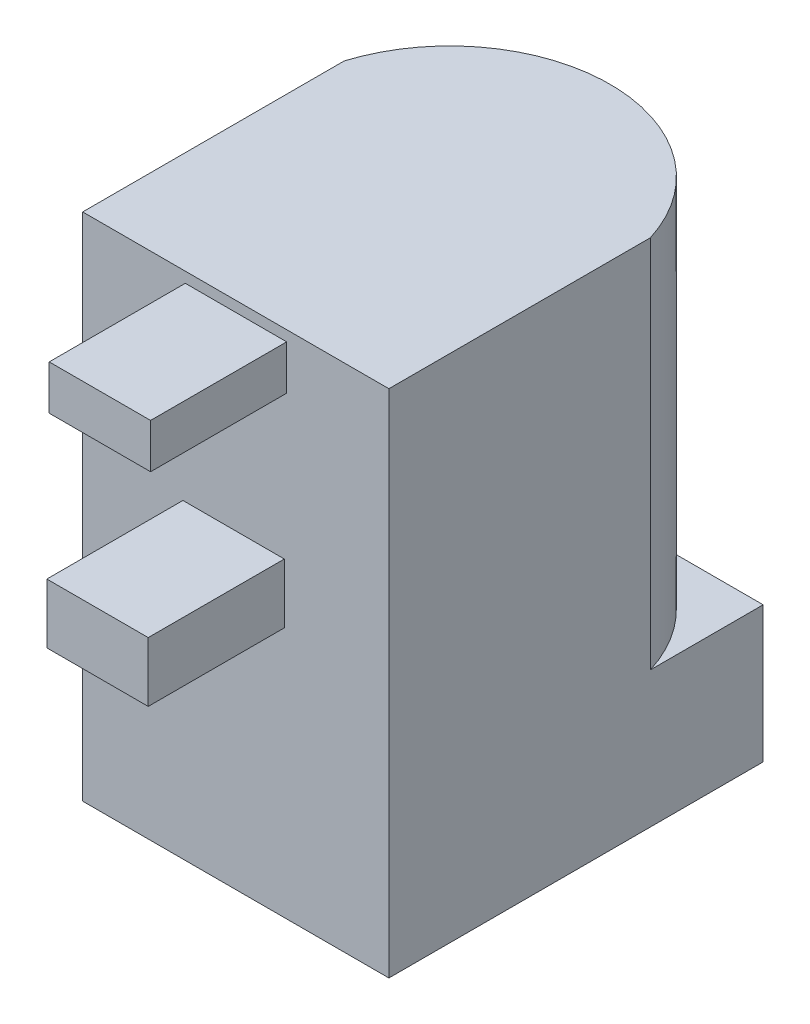
ISO-10303-21;
HEADER;
FILE_DESCRIPTION(('STEP AP214'),'2;1');
FILE_NAME('part.step','',(''),(''),'','','');
FILE_SCHEMA(('AUTOMOTIVE_DESIGN { 1 0 10303 214 1 1 1 1 }'));
ENDSEC;
DATA;
#1=APPLICATION_CONTEXT('core data for automotive mechanical design processes');
#2=APPLICATION_PROTOCOL_DEFINITION('international standard','automotive_design',2000,#1);
#3=PRODUCT_CONTEXT('',#1,'mechanical');
#4=PRODUCT('Part','Part','',(#3));
#5=PRODUCT_RELATED_PRODUCT_CATEGORY('part','',(#4));
#6=PRODUCT_DEFINITION_FORMATION('','',#4);
#7=PRODUCT_DEFINITION_CONTEXT('part definition',#1,'design');
#8=PRODUCT_DEFINITION('design','',#6,#7);
#9=PRODUCT_DEFINITION_SHAPE('','',#8);
#10=(LENGTH_UNIT() NAMED_UNIT(*) SI_UNIT(.MILLI.,.METRE.));
#11=(NAMED_UNIT(*) PLANE_ANGLE_UNIT() SI_UNIT($,.RADIAN.));
#12=(NAMED_UNIT(*) SI_UNIT($,.STERADIAN.) SOLID_ANGLE_UNIT());
#13=UNCERTAINTY_MEASURE_WITH_UNIT(LENGTH_MEASURE(1.E-05),#10,'distance_accuracy_value','');
#14=(GEOMETRIC_REPRESENTATION_CONTEXT(3) GLOBAL_UNCERTAINTY_ASSIGNED_CONTEXT((#13)) GLOBAL_UNIT_ASSIGNED_CONTEXT((#10,
#11,#12)) REPRESENTATION_CONTEXT('',''));
#15=CARTESIAN_POINT('',(0.,0.,0.));
#16=DIRECTION('',(0.,0.,1.));
#17=DIRECTION('',(1.,0.,0.));
#18=AXIS2_PLACEMENT_3D('',#15,#16,#17);
#19=CARTESIAN_POINT('',(-3.84818941504178,15.,5.33426183844011));
#20=DIRECTION('',(0.,0.,-1.));
#21=DIRECTION('',(-1.,0.,0.));
#22=AXIS2_PLACEMENT_3D('',#19,#20,#21);
#23=PLANE('',#22);
#24=DIRECTION('',(0.,-1.,0.));
#25=VECTOR('',#24,1.);
#26=CARTESIAN_POINT('',(-0.832403017018213,13.3838371317521,5.33426183844011));
#27=LINE('',#26,#25);
#28=CARTESIAN_POINT('',(-0.832403017018213,14.6905222156593,5.33426183844011));
#29=VERTEX_POINT('',#28);
#30=CARTESIAN_POINT('',(-0.832403017018213,13.3838371317521,5.33426183844011));
#31=VERTEX_POINT('',#30);
#32=EDGE_CURVE('E160',#29,#31,#27,.T.);
#33=ORIENTED_EDGE('',*,*,#32,.F.);
#34=DIRECTION('',(-1.,0.,0.));
#35=VECTOR('',#34,1.);
#36=CARTESIAN_POINT('',(-0.832403017018213,14.6905222156593,5.33426183844011));
#37=LINE('',#36,#35);
#38=CARTESIAN_POINT('',(2.14747638164835,14.6905222156593,5.33426183844011));
#39=VERTEX_POINT('',#38);
#40=EDGE_CURVE('E173',#39,#29,#37,.T.);
#41=ORIENTED_EDGE('',*,*,#40,.F.);
#42=DIRECTION('',(0.,1.,0.));
#43=VECTOR('',#42,1.);
#44=CARTESIAN_POINT('',(2.14747638164835,13.3838371317521,5.33426183844011));
#45=LINE('',#44,#43);
#46=CARTESIAN_POINT('',(2.14747638164835,13.3838371317521,5.33426183844011));
#47=VERTEX_POINT('',#46);
#48=EDGE_CURVE('E182',#47,#39,#45,.T.);
#49=ORIENTED_EDGE('',*,*,#48,.F.);
#50=DIRECTION('',(1.,0.,0.));
#51=VECTOR('',#50,1.);
#52=CARTESIAN_POINT('',(-0.832403017018213,13.3838371317521,5.33426183844011));
#53=LINE('',#52,#51);
#54=EDGE_CURVE('E163',#31,#47,#53,.T.);
#55=ORIENTED_EDGE('',*,*,#54,.F.);
#56=EDGE_LOOP('',(#33,#41,#49,#55));
#57=FACE_BOUND('',#56,.T.);
#58=DIRECTION('',(1.,0.,0.));
#59=VECTOR('',#58,1.);
#60=CARTESIAN_POINT('',(-3.84818941504178,0.,5.33426183844011));
#61=LINE('',#60,#59);
#62=CARTESIAN_POINT('',(-3.84818941504178,0.,5.33426183844011));
#63=VERTEX_POINT('',#62);
#64=CARTESIAN_POINT('',(5.15181058495822,0.,5.33426183844011));
#65=VERTEX_POINT('',#64);
#66=EDGE_CURVE('E232',#63,#65,#61,.T.);
#67=ORIENTED_EDGE('',*,*,#66,.T.);
#68=DIRECTION('',(0.,-1.,0.));
#69=VECTOR('',#68,1.);
#70=CARTESIAN_POINT('',(5.15181058495822,15.,5.33426183844011));
#71=LINE('',#70,#69);
#72=CARTESIAN_POINT('',(5.15181058495822,15.,5.33426183844011));
#73=VERTEX_POINT('',#72);
#74=EDGE_CURVE('E242',#73,#65,#71,.T.);
#75=ORIENTED_EDGE('',*,*,#74,.F.);
#76=DIRECTION('',(1.,0.,0.));
#77=VECTOR('',#76,1.);
#78=CARTESIAN_POINT('',(-3.84818941504178,15.,5.33426183844011));
#79=LINE('',#78,#77);
#80=CARTESIAN_POINT('',(-3.84818941504178,15.,5.33426183844011));
#81=VERTEX_POINT('',#80);
#82=EDGE_CURVE('E223',#81,#73,#79,.T.);
#83=ORIENTED_EDGE('',*,*,#82,.F.);
#84=DIRECTION('',(0.,-1.,0.));
#85=VECTOR('',#84,1.);
#86=CARTESIAN_POINT('',(-3.84818941504178,15.,5.33426183844011));
#87=LINE('',#86,#85);
#88=EDGE_CURVE('E245',#81,#63,#87,.T.);
#89=ORIENTED_EDGE('',*,*,#88,.T.);
#90=EDGE_LOOP('',(#67,#75,#83,#89));
#91=FACE_BOUND('',#90,.T.);
#92=DIRECTION('',(0.,-1.,0.));
#93=VECTOR('',#92,1.);
#94=CARTESIAN_POINT('',(-0.901871002237108,9.12840277679505,5.33426183844011));
#95=LINE('',#94,#93);
#96=CARTESIAN_POINT('',(-0.901871002237108,9.12840277679505,5.33426183844011));
#97=VERTEX_POINT('',#96);
#98=CARTESIAN_POINT('',(-0.901871002237108,7.37553254228531,5.33426183844011));
#99=VERTEX_POINT('',#98);
#100=EDGE_CURVE('E159',#97,#99,#95,.T.);
#101=ORIENTED_EDGE('',*,*,#100,.F.);
#102=DIRECTION('',(-1.,0.,0.));
#103=VECTOR('',#102,1.);
#104=CARTESIAN_POINT('',(-0.901871002237108,9.12840277679505,5.33426183844011));
#105=LINE('',#104,#103);
#106=CARTESIAN_POINT('',(2.07800839642946,9.12840277679505,5.33426183844011));
#107=VERTEX_POINT('',#106);
#108=EDGE_CURVE('E156',#107,#97,#105,.T.);
#109=ORIENTED_EDGE('',*,*,#108,.F.);
#110=DIRECTION('',(0.,1.,0.));
#111=VECTOR('',#110,1.);
#112=CARTESIAN_POINT('',(2.07800839642945,9.12840277679505,5.33426183844011));
#113=LINE('',#112,#111);
#114=CARTESIAN_POINT('',(2.07800839642945,7.37553254228531,5.33426183844011));
#115=VERTEX_POINT('',#114);
#116=EDGE_CURVE('E55',#115,#107,#113,.T.);
#117=ORIENTED_EDGE('',*,*,#116,.F.);
#118=DIRECTION('',(1.,0.,0.));
#119=VECTOR('',#118,1.);
#120=CARTESIAN_POINT('',(-0.901871002237108,7.37553254228531,5.33426183844011));
#121=LINE('',#120,#119);
#122=EDGE_CURVE('E50',#99,#115,#121,.T.);
#123=ORIENTED_EDGE('',*,*,#122,.F.);
#124=EDGE_LOOP('',(#101,#109,#117,#123));
#125=FACE_BOUND('',#124,.T.);
#126=ADVANCED_FACE('F35',(#57,#91,#125),#23,.F.);
#127=CARTESIAN_POINT('',(0.,15.,0.));
#128=DIRECTION('',(0.,1.,0.));
#129=DIRECTION('',(0.,0.,1.));
#130=AXIS2_PLACEMENT_3D('',#127,#128,#129);
#131=PLANE('',#130);
#132=CARTESIAN_POINT('',(0.651810584958218,15.,-0.953836315234177));
#133=DIRECTION('',(0.,1.,0.));
#134=DIRECTION('',(0.,0.,1.));
#135=AXIS2_PLACEMENT_3D('',#132,#133,#134);
#136=CIRCLE('',#135,4.71190184632571);
#137=CARTESIAN_POINT('',(-3.84818941504178,15.,-2.35098305391542));
#138=VERTEX_POINT('',#137);
#139=CARTESIAN_POINT('',(5.15181058495822,15.,-2.35098305391542));
#140=VERTEX_POINT('',#139);
#141=EDGE_CURVE('E247',#138,#140,#136,.F.);
#142=ORIENTED_EDGE('',*,*,#141,.F.);
#143=DIRECTION('',(0.,0.,1.));
#144=VECTOR('',#143,1.);
#145=CARTESIAN_POINT('',(-3.84818941504178,15.,-5.66573816155989));
#146=LINE('',#145,#144);
#147=EDGE_CURVE('E221',#138,#81,#146,.T.);
#148=ORIENTED_EDGE('',*,*,#147,.T.);
#149=ORIENTED_EDGE('',*,*,#82,.T.);
#150=DIRECTION('',(0.,0.,-1.));
#151=VECTOR('',#150,1.);
#152=CARTESIAN_POINT('',(5.15181058495822,15.,-5.66573816155989));
#153=LINE('',#152,#151);
#154=EDGE_CURVE('E226',#73,#140,#153,.T.);
#155=ORIENTED_EDGE('',*,*,#154,.T.);
#156=EDGE_LOOP('',(#142,#148,#149,#155));
#157=FACE_BOUND('',#156,.T.);
#158=ADVANCED_FACE('F285',(#157),#131,.T.);
#159=CARTESIAN_POINT('',(-3.84818941504178,15.,-5.66573816155989));
#160=DIRECTION('',(1.,0.,0.));
#161=DIRECTION('',(0.,0.,-1.));
#162=AXIS2_PLACEMENT_3D('',#159,#160,#161);
#163=PLANE('',#162);
#164=ORIENTED_EDGE('',*,*,#147,.F.);
#165=DIRECTION('',(0.,1.,0.));
#166=VECTOR('',#165,1.);
#167=CARTESIAN_POINT('',(-3.84818941504178,4.,-2.35098305391542));
#168=LINE('',#167,#166);
#169=CARTESIAN_POINT('',(-3.84818941504178,4.,-2.35098305391542));
#170=VERTEX_POINT('',#169);
#171=EDGE_CURVE('E209',#170,#138,#168,.T.);
#172=ORIENTED_EDGE('',*,*,#171,.F.);
#173=DIRECTION('',(0.,0.,-1.));
#174=VECTOR('',#173,1.);
#175=CARTESIAN_POINT('',(-3.84818941504178,4.,-5.66573816155989));
#176=LINE('',#175,#174);
#177=CARTESIAN_POINT('',(-3.84818941504178,4.,-5.66573816155989));
#178=VERTEX_POINT('',#177);
#179=EDGE_CURVE('E217',#170,#178,#176,.T.);
#180=ORIENTED_EDGE('',*,*,#179,.T.);
#181=DIRECTION('',(0.,-1.,0.));
#182=VECTOR('',#181,1.);
#183=CARTESIAN_POINT('',(-3.84818941504178,15.,-5.66573816155989));
#184=LINE('',#183,#182);
#185=CARTESIAN_POINT('',(-3.84818941504178,0.,-5.66573816155989));
#186=VERTEX_POINT('',#185);
#187=EDGE_CURVE('E229',#178,#186,#184,.T.);
#188=ORIENTED_EDGE('',*,*,#187,.T.);
#189=DIRECTION('',(0.,0.,1.));
#190=VECTOR('',#189,1.);
#191=CARTESIAN_POINT('',(-3.84818941504178,0.,-5.66573816155989));
#192=LINE('',#191,#190);
#193=EDGE_CURVE('E220',#186,#63,#192,.T.);
#194=ORIENTED_EDGE('',*,*,#193,.T.);
#195=ORIENTED_EDGE('',*,*,#88,.F.);
#196=EDGE_LOOP('',(#164,#172,#180,#188,#194,#195));
#197=FACE_BOUND('',#196,.T.);
#198=ADVANCED_FACE('F37',(#197),#163,.F.);
#199=CARTESIAN_POINT('',(5.15181058495822,15.,-5.66573816155989));
#200=DIRECTION('',(-1.,0.,0.));
#201=DIRECTION('',(0.,0.,1.));
#202=AXIS2_PLACEMENT_3D('',#199,#200,#201);
#203=PLANE('',#202);
#204=DIRECTION('',(0.,0.,1.));
#205=VECTOR('',#204,1.);
#206=CARTESIAN_POINT('',(5.15181058495822,4.,-5.66573816155989));
#207=LINE('',#206,#205);
#208=CARTESIAN_POINT('',(5.15181058495822,4.,-5.66573816155989));
#209=VERTEX_POINT('',#208);
#210=CARTESIAN_POINT('',(5.15181058495822,4.,-2.35098305391542));
#211=VERTEX_POINT('',#210);
#212=EDGE_CURVE('E212',#209,#211,#207,.T.);
#213=ORIENTED_EDGE('',*,*,#212,.T.);
#214=DIRECTION('',(0.,1.,0.));
#215=VECTOR('',#214,1.);
#216=CARTESIAN_POINT('',(5.15181058495822,4.,-2.35098305391542));
#217=LINE('',#216,#215);
#218=EDGE_CURVE('E208',#211,#140,#217,.T.);
#219=ORIENTED_EDGE('',*,*,#218,.T.);
#220=ORIENTED_EDGE('',*,*,#154,.F.);
#221=ORIENTED_EDGE('',*,*,#74,.T.);
#222=DIRECTION('',(0.,0.,-1.));
#223=VECTOR('',#222,1.);
#224=CARTESIAN_POINT('',(5.15181058495822,0.,-5.66573816155989));
#225=LINE('',#224,#223);
#226=CARTESIAN_POINT('',(5.15181058495822,0.,-5.66573816155989));
#227=VERTEX_POINT('',#226);
#228=EDGE_CURVE('E234',#65,#227,#225,.T.);
#229=ORIENTED_EDGE('',*,*,#228,.T.);
#230=DIRECTION('',(0.,-1.,0.));
#231=VECTOR('',#230,1.);
#232=CARTESIAN_POINT('',(5.15181058495822,15.,-5.66573816155989));
#233=LINE('',#232,#231);
#234=EDGE_CURVE('E240',#209,#227,#233,.T.);
#235=ORIENTED_EDGE('',*,*,#234,.F.);
#236=EDGE_LOOP('',(#213,#219,#220,#221,#229,#235));
#237=FACE_BOUND('',#236,.T.);
#238=ADVANCED_FACE('F258',(#237),#203,.F.);
#239=CARTESIAN_POINT('',(-3.84818941504178,15.,-5.66573816155989));
#240=DIRECTION('',(0.,0.,1.));
#241=DIRECTION('',(1.,0.,0.));
#242=AXIS2_PLACEMENT_3D('',#239,#240,#241);
#243=PLANE('',#242);
#244=ORIENTED_EDGE('',*,*,#187,.F.);
#245=DIRECTION('',(1.,0.,0.));
#246=VECTOR('',#245,1.);
#247=CARTESIAN_POINT('',(-3.84818941504178,4.,-5.66573816155989));
#248=LINE('',#247,#246);
#249=CARTESIAN_POINT('',(0.651810584958218,4.,-5.66573816155989));
#250=VERTEX_POINT('',#249);
#251=EDGE_CURVE('E11',#178,#250,#248,.T.);
#252=ORIENTED_EDGE('',*,*,#251,.T.);
#253=EDGE_CURVE('E39',#250,#209,#248,.T.);
#254=ORIENTED_EDGE('',*,*,#253,.T.);
#255=ORIENTED_EDGE('',*,*,#234,.T.);
#256=DIRECTION('',(-1.,0.,0.));
#257=VECTOR('',#256,1.);
#258=CARTESIAN_POINT('',(-3.84818941504178,0.,-5.66573816155989));
#259=LINE('',#258,#257);
#260=EDGE_CURVE('E224',#227,#186,#259,.T.);
#261=ORIENTED_EDGE('',*,*,#260,.T.);
#262=EDGE_LOOP('',(#244,#252,#254,#255,#261));
#263=FACE_BOUND('',#262,.T.);
#264=ADVANCED_FACE('F254',(#263),#243,.F.);
#265=CARTESIAN_POINT('',(0.,0.,0.));
#266=DIRECTION('',(0.,1.,0.));
#267=DIRECTION('',(0.,0.,1.));
#268=AXIS2_PLACEMENT_3D('',#265,#266,#267);
#269=PLANE('',#268);
#270=CARTESIAN_POINT('',(0.651810584958219,0.,-0.165738161559888));
#271=DIRECTION('',(0.,-1.,0.));
#272=DIRECTION('',(0.,0.,-1.));
#273=AXIS2_PLACEMENT_3D('',#270,#271,#272);
#274=CIRCLE('',#273,3.15);
#275=CARTESIAN_POINT('',(0.651810584958219,0.,-3.31573816155989));
#276=VERTEX_POINT('',#275);
#277=EDGE_CURVE('E198',#276,#276,#274,.T.);
#278=ORIENTED_EDGE('',*,*,#277,.F.);
#279=EDGE_LOOP('',(#278));
#280=FACE_BOUND('',#279,.T.);
#281=ORIENTED_EDGE('',*,*,#193,.F.);
#282=ORIENTED_EDGE('',*,*,#260,.F.);
#283=ORIENTED_EDGE('',*,*,#228,.F.);
#284=ORIENTED_EDGE('',*,*,#66,.F.);
#285=EDGE_LOOP('',(#281,#282,#283,#284));
#286=FACE_BOUND('',#285,.T.);
#287=ADVANCED_FACE('F265',(#280,#286),#269,.F.);
#288=CARTESIAN_POINT('',(0.651810584958218,4.,-0.953836315234177));
#289=DIRECTION('',(0.,-1.,0.));
#290=DIRECTION('',(0.,0.,-1.));
#291=AXIS2_PLACEMENT_3D('',#288,#289,#290);
#292=PLANE('',#291);
#293=CARTESIAN_POINT('',(0.651810584958218,4.,-0.953836315234177));
#294=DIRECTION('',(0.,-1.,0.));
#295=DIRECTION('',(0.,0.,-1.));
#296=AXIS2_PLACEMENT_3D('',#293,#294,#295);
#297=CIRCLE('',#296,4.71190184632571);
#298=EDGE_CURVE('E205',#170,#250,#297,.T.);
#299=ORIENTED_EDGE('',*,*,#298,.T.);
#300=ORIENTED_EDGE('',*,*,#251,.F.);
#301=ORIENTED_EDGE('',*,*,#179,.F.);
#302=EDGE_LOOP('',(#299,#300,#301));
#303=FACE_BOUND('',#302,.T.);
#304=ADVANCED_FACE('F272',(#303),#292,.F.);
#305=ORIENTED_EDGE('',*,*,#253,.F.);
#306=EDGE_CURVE('E202',#250,#211,#297,.T.);
#307=ORIENTED_EDGE('',*,*,#306,.T.);
#308=ORIENTED_EDGE('',*,*,#212,.F.);
#309=EDGE_LOOP('',(#305,#307,#308));
#310=FACE_BOUND('',#309,.T.);
#311=ADVANCED_FACE('F274',(#310),#292,.F.);
#312=CARTESIAN_POINT('',(0.651810584958218,4.,-0.953836315234177));
#313=DIRECTION('',(0.,1.,0.));
#314=DIRECTION('',(0.,0.,1.));
#315=AXIS2_PLACEMENT_3D('',#312,#313,#314);
#316=CYLINDRICAL_SURFACE('',#315,4.71190184632571);
#317=ORIENTED_EDGE('',*,*,#141,.T.);
#318=ORIENTED_EDGE('',*,*,#218,.F.);
#319=ORIENTED_EDGE('',*,*,#306,.F.);
#320=ORIENTED_EDGE('',*,*,#298,.F.);
#321=ORIENTED_EDGE('',*,*,#171,.T.);
#322=EDGE_LOOP('',(#317,#318,#319,#320,#321));
#323=FACE_BOUND('',#322,.T.);
#324=ADVANCED_FACE('F273',(#323),#316,.T.);
#325=CARTESIAN_POINT('',(0.651810584958219,11.,-0.165738161559888));
#326=DIRECTION('',(0.,-1.,0.));
#327=DIRECTION('',(0.,0.,-1.));
#328=AXIS2_PLACEMENT_3D('',#325,#326,#327);
#329=CYLINDRICAL_SURFACE('',#328,3.15);
#330=CARTESIAN_POINT('',(0.651810584958219,11.,-0.165738161559888));
#331=DIRECTION('',(0.,-1.,0.));
#332=DIRECTION('',(0.,0.,-1.));
#333=AXIS2_PLACEMENT_3D('',#330,#331,#332);
#334=CIRCLE('',#333,3.15);
#335=CARTESIAN_POINT('',(0.651810584958219,11.,-3.31573816155989));
#336=VERTEX_POINT('',#335);
#337=EDGE_CURVE('E199',#336,#336,#334,.T.);
#338=ORIENTED_EDGE('',*,*,#337,.F.);
#339=EDGE_LOOP('',(#338));
#340=FACE_BOUND('',#339,.T.);
#341=ORIENTED_EDGE('',*,*,#277,.T.);
#342=EDGE_LOOP('',(#341));
#343=FACE_BOUND('',#342,.T.);
#344=ADVANCED_FACE('F281',(#340,#343),#329,.F.);
#345=CARTESIAN_POINT('',(0.651810584958219,11.,-0.165738161559888));
#346=DIRECTION('',(0.,-1.,0.));
#347=DIRECTION('',(0.,0.,-1.));
#348=AXIS2_PLACEMENT_3D('',#345,#346,#347);
#349=PLANE('',#348);
#350=ORIENTED_EDGE('',*,*,#337,.T.);
#351=EDGE_LOOP('',(#350));
#352=FACE_BOUND('',#351,.T.);
#353=ADVANCED_FACE('F305',(#352),#349,.T.);
#354=CARTESIAN_POINT('',(-0.832403017018213,13.3838371317521,9.33426183844011));
#355=DIRECTION('',(1.,0.,0.));
#356=DIRECTION('',(0.,0.,-1.));
#357=AXIS2_PLACEMENT_3D('',#354,#355,#356);
#358=PLANE('',#357);
#359=ORIENTED_EDGE('',*,*,#32,.T.);
#360=DIRECTION('',(0.,0.,-1.));
#361=VECTOR('',#360,1.);
#362=CARTESIAN_POINT('',(-0.832403017018213,13.3838371317521,9.33426183844011));
#363=LINE('',#362,#361);
#364=CARTESIAN_POINT('',(-0.832403017018213,13.3838371317521,9.33426183844011));
#365=VERTEX_POINT('',#364);
#366=EDGE_CURVE('E195',#365,#31,#363,.T.);
#367=ORIENTED_EDGE('',*,*,#366,.F.);
#368=DIRECTION('',(0.,-1.,0.));
#369=VECTOR('',#368,1.);
#370=CARTESIAN_POINT('',(-0.832403017018213,13.3838371317521,9.33426183844011));
#371=LINE('',#370,#369);
#372=CARTESIAN_POINT('',(-0.832403017018213,14.6905222156593,9.33426183844011));
#373=VERTEX_POINT('',#372);
#374=EDGE_CURVE('E169',#373,#365,#371,.T.);
#375=ORIENTED_EDGE('',*,*,#374,.F.);
#376=DIRECTION('',(0.,0.,-1.));
#377=VECTOR('',#376,1.);
#378=CARTESIAN_POINT('',(-0.832403017018213,14.6905222156593,9.33426183844011));
#379=LINE('',#378,#377);
#380=EDGE_CURVE('E178',#373,#29,#379,.T.);
#381=ORIENTED_EDGE('',*,*,#380,.T.);
#382=EDGE_LOOP('',(#359,#367,#375,#381));
#383=FACE_BOUND('',#382,.T.);
#384=ADVANCED_FACE('F310',(#383),#358,.F.);
#385=CARTESIAN_POINT('',(-0.832403017018213,13.3838371317521,9.33426183844011));
#386=DIRECTION('',(0.,1.,0.));
#387=DIRECTION('',(0.,0.,1.));
#388=AXIS2_PLACEMENT_3D('',#385,#386,#387);
#389=PLANE('',#388);
#390=ORIENTED_EDGE('',*,*,#54,.T.);
#391=DIRECTION('',(0.,0.,-1.));
#392=VECTOR('',#391,1.);
#393=CARTESIAN_POINT('',(2.14747638164835,13.3838371317521,9.33426183844011));
#394=LINE('',#393,#392);
#395=CARTESIAN_POINT('',(2.14747638164835,13.3838371317521,9.33426183844011));
#396=VERTEX_POINT('',#395);
#397=EDGE_CURVE('E192',#396,#47,#394,.T.);
#398=ORIENTED_EDGE('',*,*,#397,.F.);
#399=DIRECTION('',(1.,0.,0.));
#400=VECTOR('',#399,1.);
#401=CARTESIAN_POINT('',(-0.832403017018213,13.3838371317521,9.33426183844011));
#402=LINE('',#401,#400);
#403=EDGE_CURVE('E172',#365,#396,#402,.T.);
#404=ORIENTED_EDGE('',*,*,#403,.F.);
#405=ORIENTED_EDGE('',*,*,#366,.T.);
#406=EDGE_LOOP('',(#390,#398,#404,#405));
#407=FACE_BOUND('',#406,.T.);
#408=ADVANCED_FACE('F317',(#407),#389,.F.);
#409=CARTESIAN_POINT('',(2.14747638164835,13.3838371317521,9.33426183844011));
#410=DIRECTION('',(-1.,0.,0.));
#411=DIRECTION('',(0.,0.,1.));
#412=AXIS2_PLACEMENT_3D('',#409,#410,#411);
#413=PLANE('',#412);
#414=ORIENTED_EDGE('',*,*,#48,.T.);
#415=DIRECTION('',(0.,0.,-1.));
#416=VECTOR('',#415,1.);
#417=CARTESIAN_POINT('',(2.14747638164835,14.6905222156593,9.33426183844011));
#418=LINE('',#417,#416);
#419=CARTESIAN_POINT('',(2.14747638164835,14.6905222156593,9.33426183844011));
#420=VERTEX_POINT('',#419);
#421=EDGE_CURVE('E189',#420,#39,#418,.T.);
#422=ORIENTED_EDGE('',*,*,#421,.F.);
#423=DIRECTION('',(0.,1.,0.));
#424=VECTOR('',#423,1.);
#425=CARTESIAN_POINT('',(2.14747638164835,13.3838371317521,9.33426183844011));
#426=LINE('',#425,#424);
#427=EDGE_CURVE('E175',#396,#420,#426,.T.);
#428=ORIENTED_EDGE('',*,*,#427,.F.);
#429=ORIENTED_EDGE('',*,*,#397,.T.);
#430=EDGE_LOOP('',(#414,#422,#428,#429));
#431=FACE_BOUND('',#430,.T.);
#432=ADVANCED_FACE('F321',(#431),#413,.F.);
#433=CARTESIAN_POINT('',(-0.832403017018213,14.6905222156593,9.33426183844011));
#434=DIRECTION('',(0.,-1.,0.));
#435=DIRECTION('',(0.,0.,-1.));
#436=AXIS2_PLACEMENT_3D('',#433,#434,#435);
#437=PLANE('',#436);
#438=ORIENTED_EDGE('',*,*,#40,.T.);
#439=ORIENTED_EDGE('',*,*,#380,.F.);
#440=DIRECTION('',(-1.,0.,0.));
#441=VECTOR('',#440,1.);
#442=CARTESIAN_POINT('',(-0.832403017018213,14.6905222156593,9.33426183844011));
#443=LINE('',#442,#441);
#444=EDGE_CURVE('E177',#420,#373,#443,.T.);
#445=ORIENTED_EDGE('',*,*,#444,.F.);
#446=ORIENTED_EDGE('',*,*,#421,.T.);
#447=EDGE_LOOP('',(#438,#439,#445,#446));
#448=FACE_BOUND('',#447,.T.);
#449=ADVANCED_FACE('F325',(#448),#437,.F.);
#450=CARTESIAN_POINT('',(0.,0.,9.33426183844011));
#451=DIRECTION('',(0.,0.,-1.));
#452=DIRECTION('',(-1.,0.,0.));
#453=AXIS2_PLACEMENT_3D('',#450,#451,#452);
#454=PLANE('',#453);
#455=ORIENTED_EDGE('',*,*,#374,.T.);
#456=ORIENTED_EDGE('',*,*,#403,.T.);
#457=ORIENTED_EDGE('',*,*,#427,.T.);
#458=ORIENTED_EDGE('',*,*,#444,.T.);
#459=EDGE_LOOP('',(#455,#456,#457,#458));
#460=FACE_BOUND('',#459,.T.);
#461=ADVANCED_FACE('F329',(#460),#454,.F.);
#462=CARTESIAN_POINT('',(-0.901871002237108,9.12840277679505,9.33426183844011));
#463=DIRECTION('',(1.,0.,0.));
#464=DIRECTION('',(0.,1.,0.));
#465=AXIS2_PLACEMENT_3D('',#462,#463,#464);
#466=PLANE('',#465);
#467=ORIENTED_EDGE('',*,*,#100,.T.);
#468=DIRECTION('',(0.,0.,-1.));
#469=VECTOR('',#468,1.);
#470=CARTESIAN_POINT('',(-0.901871002237108,7.37553254228531,9.33426183844011));
#471=LINE('',#470,#469);
#472=CARTESIAN_POINT('',(-0.901871002237108,7.37553254228531,9.33426183844011));
#473=VERTEX_POINT('',#472);
#474=EDGE_CURVE('E140',#473,#99,#471,.T.);
#475=ORIENTED_EDGE('',*,*,#474,.F.);
#476=DIRECTION('',(0.,-1.,0.));
#477=VECTOR('',#476,1.);
#478=CARTESIAN_POINT('',(-0.901871002237108,9.12840277679505,9.33426183844011));
#479=LINE('',#478,#477);
#480=CARTESIAN_POINT('',(-0.901871002237108,9.12840277679505,9.33426183844011));
#481=VERTEX_POINT('',#480);
#482=EDGE_CURVE('E147',#481,#473,#479,.T.);
#483=ORIENTED_EDGE('',*,*,#482,.F.);
#484=DIRECTION('',(0.,0.,-1.));
#485=VECTOR('',#484,1.);
#486=CARTESIAN_POINT('',(-0.901871002237108,9.12840277679505,9.33426183844011));
#487=LINE('',#486,#485);
#488=EDGE_CURVE('E468',#481,#97,#487,.T.);
#489=ORIENTED_EDGE('',*,*,#488,.T.);
#490=EDGE_LOOP('',(#467,#475,#483,#489));
#491=FACE_BOUND('',#490,.T.);
#492=ADVANCED_FACE('F158',(#491),#466,.F.);
#493=CARTESIAN_POINT('',(-0.901871002237108,7.37553254228531,9.33426183844011));
#494=DIRECTION('',(0.,1.,0.));
#495=DIRECTION('',(0.,0.,1.));
#496=AXIS2_PLACEMENT_3D('',#493,#494,#495);
#497=PLANE('',#496);
#498=ORIENTED_EDGE('',*,*,#122,.T.);
#499=DIRECTION('',(0.,0.,-1.));
#500=VECTOR('',#499,1.);
#501=CARTESIAN_POINT('',(2.07800839642945,7.37553254228531,9.33426183844011));
#502=LINE('',#501,#500);
#503=CARTESIAN_POINT('',(2.07800839642945,7.37553254228531,9.33426183844011));
#504=VERTEX_POINT('',#503);
#505=EDGE_CURVE('E143',#504,#115,#502,.T.);
#506=ORIENTED_EDGE('',*,*,#505,.F.);
#507=DIRECTION('',(1.,0.,0.));
#508=VECTOR('',#507,1.);
#509=CARTESIAN_POINT('',(-0.901871002237108,7.37553254228531,9.33426183844011));
#510=LINE('',#509,#508);
#511=EDGE_CURVE('E136',#473,#504,#510,.T.);
#512=ORIENTED_EDGE('',*,*,#511,.F.);
#513=ORIENTED_EDGE('',*,*,#474,.T.);
#514=EDGE_LOOP('',(#498,#506,#512,#513));
#515=FACE_BOUND('',#514,.T.);
#516=ADVANCED_FACE('F138',(#515),#497,.F.);
#517=CARTESIAN_POINT('',(2.07800839642945,9.12840277679505,9.33426183844011));
#518=DIRECTION('',(-1.,0.,0.));
#519=DIRECTION('',(0.,0.,1.));
#520=AXIS2_PLACEMENT_3D('',#517,#518,#519);
#521=PLANE('',#520);
#522=ORIENTED_EDGE('',*,*,#116,.T.);
#523=DIRECTION('',(0.,0.,-1.));
#524=VECTOR('',#523,1.);
#525=CARTESIAN_POINT('',(2.07800839642945,9.12840277679505,9.33426183844011));
#526=LINE('',#525,#524);
#527=CARTESIAN_POINT('',(2.07800839642945,9.12840277679505,9.33426183844011));
#528=VERTEX_POINT('',#527);
#529=EDGE_CURVE('E165',#528,#107,#526,.T.);
#530=ORIENTED_EDGE('',*,*,#529,.F.);
#531=DIRECTION('',(0.,1.,0.));
#532=VECTOR('',#531,1.);
#533=CARTESIAN_POINT('',(2.07800839642945,9.12840277679505,9.33426183844011));
#534=LINE('',#533,#532);
#535=EDGE_CURVE('E146',#504,#528,#534,.T.);
#536=ORIENTED_EDGE('',*,*,#535,.F.);
#537=ORIENTED_EDGE('',*,*,#505,.T.);
#538=EDGE_LOOP('',(#522,#530,#536,#537));
#539=FACE_BOUND('',#538,.T.);
#540=ADVANCED_FACE('F338',(#539),#521,.F.);
#541=CARTESIAN_POINT('',(-0.901871002237108,9.12840277679505,9.33426183844011));
#542=DIRECTION('',(0.,-1.,0.));
#543=DIRECTION('',(0.,0.,-1.));
#544=AXIS2_PLACEMENT_3D('',#541,#542,#543);
#545=PLANE('',#544);
#546=ORIENTED_EDGE('',*,*,#108,.T.);
#547=ORIENTED_EDGE('',*,*,#488,.F.);
#548=DIRECTION('',(-1.,0.,0.));
#549=VECTOR('',#548,1.);
#550=CARTESIAN_POINT('',(-0.901871002237108,9.12840277679505,9.33426183844011));
#551=LINE('',#550,#549);
#552=EDGE_CURVE('E152',#528,#481,#551,.T.);
#553=ORIENTED_EDGE('',*,*,#552,.F.);
#554=ORIENTED_EDGE('',*,*,#529,.T.);
#555=EDGE_LOOP('',(#546,#547,#553,#554));
#556=FACE_BOUND('',#555,.T.);
#557=ADVANCED_FACE('F341',(#556),#545,.F.);
#558=CARTESIAN_POINT('',(0.,0.,9.33426183844011));
#559=DIRECTION('',(0.,0.,1.));
#560=DIRECTION('',(1.,0.,0.));
#561=AXIS2_PLACEMENT_3D('',#558,#559,#560);
#562=PLANE('',#561);
#563=ORIENTED_EDGE('',*,*,#482,.T.);
#564=ORIENTED_EDGE('',*,*,#511,.T.);
#565=ORIENTED_EDGE('',*,*,#535,.T.);
#566=ORIENTED_EDGE('',*,*,#552,.T.);
#567=EDGE_LOOP('',(#563,#564,#565,#566));
#568=FACE_BOUND('',#567,.T.);
#569=ADVANCED_FACE('F150',(#568),#562,.T.);
#570=CLOSED_SHELL('',(#126,#158,#198,#238,#264,#287,#304,#311,#324,#344,#353,#384,#408,#432,
#449,#461,#492,#516,#540,#557,#569));
#571=MANIFOLD_SOLID_BREP('B2',#570);
#572=ADVANCED_BREP_SHAPE_REPRESENTATION('',(#18,#571),#14);
#573=SHAPE_DEFINITION_REPRESENTATION(#9,#572);
ENDSEC;
END-ISO-10303-21;
